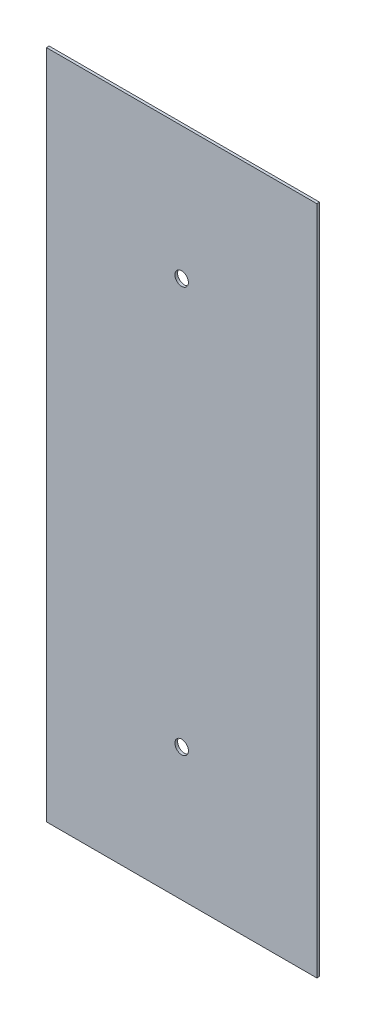
ISO-10303-21;
HEADER;
FILE_DESCRIPTION(('STEP AP214'),'2;1');
FILE_NAME('part.step','',(''),(''),'','','');
FILE_SCHEMA(('AUTOMOTIVE_DESIGN { 1 0 10303 214 1 1 1 1 }'));
ENDSEC;
DATA;
#1=APPLICATION_CONTEXT('core data for automotive mechanical design processes');
#2=APPLICATION_PROTOCOL_DEFINITION('international standard','automotive_design',2000,#1);
#3=PRODUCT_CONTEXT('',#1,'mechanical');
#4=PRODUCT('Part','Part','',(#3));
#5=PRODUCT_RELATED_PRODUCT_CATEGORY('part','',(#4));
#6=PRODUCT_DEFINITION_FORMATION('','',#4);
#7=PRODUCT_DEFINITION_CONTEXT('part definition',#1,'design');
#8=PRODUCT_DEFINITION('design','',#6,#7);
#9=PRODUCT_DEFINITION_SHAPE('','',#8);
#10=(LENGTH_UNIT() NAMED_UNIT(*) SI_UNIT(.MILLI.,.METRE.));
#11=(NAMED_UNIT(*) PLANE_ANGLE_UNIT() SI_UNIT($,.RADIAN.));
#12=(NAMED_UNIT(*) SI_UNIT($,.STERADIAN.) SOLID_ANGLE_UNIT());
#13=UNCERTAINTY_MEASURE_WITH_UNIT(LENGTH_MEASURE(1.E-05),#10,'distance_accuracy_value','');
#14=(GEOMETRIC_REPRESENTATION_CONTEXT(3) GLOBAL_UNCERTAINTY_ASSIGNED_CONTEXT((#13)) GLOBAL_UNIT_ASSIGNED_CONTEXT((#10,
#11,#12)) REPRESENTATION_CONTEXT('',''));
#15=CARTESIAN_POINT('',(0.,0.,0.));
#16=DIRECTION('',(0.,0.,1.));
#17=DIRECTION('',(1.,0.,0.));
#18=AXIS2_PLACEMENT_3D('',#15,#16,#17);
#19=CARTESIAN_POINT('',(0.,0.,2.));
#20=DIRECTION('',(0.,0.,-1.));
#21=DIRECTION('',(-1.,0.,0.));
#22=AXIS2_PLACEMENT_3D('',#19,#20,#21);
#23=PLANE('',#22);
#24=CARTESIAN_POINT('',(0.,-150.,2.));
#25=DIRECTION('',(0.,0.,-1.));
#26=DIRECTION('',(-1.,0.,0.));
#27=AXIS2_PLACEMENT_3D('',#24,#25,#26);
#28=CIRCLE('',#27,5.);
#29=CARTESIAN_POINT('',(-5.,-150.,2.));
#30=VERTEX_POINT('',#29);
#31=EDGE_CURVE('E84',#30,#30,#28,.T.);
#32=ORIENTED_EDGE('',*,*,#31,.T.);
#33=EDGE_LOOP('',(#32));
#34=FACE_BOUND('',#33,.T.);
#35=CARTESIAN_POINT('',(0.,150.,2.));
#36=DIRECTION('',(0.,0.,-1.));
#37=DIRECTION('',(-1.,0.,0.));
#38=AXIS2_PLACEMENT_3D('',#35,#36,#37);
#39=CIRCLE('',#38,5.);
#40=CARTESIAN_POINT('',(-5.,150.,2.));
#41=VERTEX_POINT('',#40);
#42=EDGE_CURVE('E19',#41,#41,#39,.T.);
#43=ORIENTED_EDGE('',*,*,#42,.T.);
#44=EDGE_LOOP('',(#43));
#45=FACE_BOUND('',#44,.T.);
#46=DIRECTION('',(1.,0.,0.));
#47=VECTOR('',#46,1.);
#48=CARTESIAN_POINT('',(100.,-248.,2.));
#49=LINE('',#48,#47);
#50=CARTESIAN_POINT('',(-100.,-248.,2.));
#51=VERTEX_POINT('',#50);
#52=CARTESIAN_POINT('',(100.,-248.,2.));
#53=VERTEX_POINT('',#52);
#54=EDGE_CURVE('E88',#51,#53,#49,.T.);
#55=ORIENTED_EDGE('',*,*,#54,.T.);
#56=DIRECTION('',(0.,-1.,0.));
#57=VECTOR('',#56,1.);
#58=CARTESIAN_POINT('',(100.,248.,2.));
#59=LINE('',#58,#57);
#60=CARTESIAN_POINT('',(100.,248.,2.));
#61=VERTEX_POINT('',#60);
#62=EDGE_CURVE('E54',#53,#61,#59,.F.);
#63=ORIENTED_EDGE('',*,*,#62,.T.);
#64=DIRECTION('',(1.,0.,0.));
#65=VECTOR('',#64,1.);
#66=CARTESIAN_POINT('',(100.,248.,2.));
#67=LINE('',#66,#65);
#68=CARTESIAN_POINT('',(-100.,248.,2.));
#69=VERTEX_POINT('',#68);
#70=EDGE_CURVE('E56',#61,#69,#67,.F.);
#71=ORIENTED_EDGE('',*,*,#70,.T.);
#72=DIRECTION('',(0.,1.,0.));
#73=VECTOR('',#72,1.);
#74=CARTESIAN_POINT('',(-100.,248.,2.));
#75=LINE('',#74,#73);
#76=EDGE_CURVE('E58',#69,#51,#75,.F.);
#77=ORIENTED_EDGE('',*,*,#76,.T.);
#78=EDGE_LOOP('',(#55,#63,#71,#77));
#79=FACE_BOUND('',#78,.T.);
#80=ADVANCED_FACE('F16',(#34,#45,#79),#23,.F.);
#81=CARTESIAN_POINT('',(0.,150.,2.));
#82=DIRECTION('',(0.,0.,-1.));
#83=DIRECTION('',(-1.,0.,0.));
#84=AXIS2_PLACEMENT_3D('',#81,#82,#83);
#85=CYLINDRICAL_SURFACE('',#84,5.);
#86=ORIENTED_EDGE('',*,*,#42,.F.);
#87=EDGE_LOOP('',(#86));
#88=FACE_BOUND('',#87,.T.);
#89=CARTESIAN_POINT('',(0.,150.,0.));
#90=DIRECTION('',(0.,0.,-1.));
#91=DIRECTION('',(-1.,0.,0.));
#92=AXIS2_PLACEMENT_3D('',#89,#90,#91);
#93=CIRCLE('',#92,5.);
#94=CARTESIAN_POINT('',(-5.,150.,0.));
#95=VERTEX_POINT('',#94);
#96=EDGE_CURVE('E81',#95,#95,#93,.F.);
#97=ORIENTED_EDGE('',*,*,#96,.F.);
#98=EDGE_LOOP('',(#97));
#99=FACE_BOUND('',#98,.T.);
#100=ADVANCED_FACE('F159',(#88,#99),#85,.F.);
#101=CARTESIAN_POINT('',(-100.,248.,2.));
#102=DIRECTION('',(1.,0.,0.));
#103=DIRECTION('',(0.,1.,0.));
#104=AXIS2_PLACEMENT_3D('',#101,#102,#103);
#105=PLANE('',#104);
#106=DIRECTION('',(0.,0.,1.));
#107=VECTOR('',#106,1.);
#108=CARTESIAN_POINT('',(-100.,-248.,2.));
#109=LINE('',#108,#107);
#110=CARTESIAN_POINT('',(-100.,-248.,0.));
#111=VERTEX_POINT('',#110);
#112=EDGE_CURVE('E69',#111,#51,#109,.T.);
#113=ORIENTED_EDGE('',*,*,#112,.T.);
#114=ORIENTED_EDGE('',*,*,#76,.F.);
#115=DIRECTION('',(0.,0.,1.));
#116=VECTOR('',#115,1.);
#117=CARTESIAN_POINT('',(-100.,248.,2.));
#118=LINE('',#117,#116);
#119=CARTESIAN_POINT('',(-100.,248.,0.));
#120=VERTEX_POINT('',#119);
#121=EDGE_CURVE('E63',#69,#120,#118,.F.);
#122=ORIENTED_EDGE('',*,*,#121,.T.);
#123=DIRECTION('',(0.,1.,0.));
#124=VECTOR('',#123,1.);
#125=CARTESIAN_POINT('',(-100.,0.,0.));
#126=LINE('',#125,#124);
#127=EDGE_CURVE('E83',#111,#120,#126,.T.);
#128=ORIENTED_EDGE('',*,*,#127,.F.);
#129=EDGE_LOOP('',(#113,#114,#122,#128));
#130=FACE_BOUND('',#129,.T.);
#131=ADVANCED_FACE('F66',(#130),#105,.F.);
#132=CARTESIAN_POINT('',(100.,248.,2.));
#133=DIRECTION('',(0.,-1.,0.));
#134=DIRECTION('',(1.,0.,0.));
#135=AXIS2_PLACEMENT_3D('',#132,#133,#134);
#136=PLANE('',#135);
#137=ORIENTED_EDGE('',*,*,#121,.F.);
#138=ORIENTED_EDGE('',*,*,#70,.F.);
#139=DIRECTION('',(0.,0.,1.));
#140=VECTOR('',#139,1.);
#141=CARTESIAN_POINT('',(100.,248.,2.));
#142=LINE('',#141,#140);
#143=CARTESIAN_POINT('',(100.,248.,0.));
#144=VERTEX_POINT('',#143);
#145=EDGE_CURVE('E77',#61,#144,#142,.F.);
#146=ORIENTED_EDGE('',*,*,#145,.T.);
#147=DIRECTION('',(-1.,0.,0.));
#148=VECTOR('',#147,1.);
#149=CARTESIAN_POINT('',(0.,248.,0.));
#150=LINE('',#149,#148);
#151=EDGE_CURVE('E74',#120,#144,#150,.F.);
#152=ORIENTED_EDGE('',*,*,#151,.F.);
#153=EDGE_LOOP('',(#137,#138,#146,#152));
#154=FACE_BOUND('',#153,.T.);
#155=ADVANCED_FACE('F72',(#154),#136,.F.);
#156=CARTESIAN_POINT('',(100.,248.,2.));
#157=DIRECTION('',(-1.,0.,0.));
#158=DIRECTION('',(0.,-1.,0.));
#159=AXIS2_PLACEMENT_3D('',#156,#157,#158);
#160=PLANE('',#159);
#161=ORIENTED_EDGE('',*,*,#145,.F.);
#162=ORIENTED_EDGE('',*,*,#62,.F.);
#163=DIRECTION('',(0.,0.,1.));
#164=VECTOR('',#163,1.);
#165=CARTESIAN_POINT('',(100.,-248.,2.));
#166=LINE('',#165,#164);
#167=CARTESIAN_POINT('',(100.,-248.,0.));
#168=VERTEX_POINT('',#167);
#169=EDGE_CURVE('E34',#53,#168,#166,.F.);
#170=ORIENTED_EDGE('',*,*,#169,.T.);
#171=DIRECTION('',(0.,1.,0.));
#172=VECTOR('',#171,1.);
#173=CARTESIAN_POINT('',(100.,0.,0.));
#174=LINE('',#173,#172);
#175=EDGE_CURVE('E95',#144,#168,#174,.F.);
#176=ORIENTED_EDGE('',*,*,#175,.F.);
#177=EDGE_LOOP('',(#161,#162,#170,#176));
#178=FACE_BOUND('',#177,.T.);
#179=ADVANCED_FACE('F96',(#178),#160,.F.);
#180=CARTESIAN_POINT('',(100.,-248.,2.));
#181=DIRECTION('',(0.,1.,0.));
#182=DIRECTION('',(0.,0.,1.));
#183=AXIS2_PLACEMENT_3D('',#180,#181,#182);
#184=PLANE('',#183);
#185=ORIENTED_EDGE('',*,*,#169,.F.);
#186=ORIENTED_EDGE('',*,*,#54,.F.);
#187=ORIENTED_EDGE('',*,*,#112,.F.);
#188=DIRECTION('',(-1.,0.,0.));
#189=VECTOR('',#188,1.);
#190=CARTESIAN_POINT('',(0.,-248.,0.));
#191=LINE('',#190,#189);
#192=EDGE_CURVE('E25',#168,#111,#191,.T.);
#193=ORIENTED_EDGE('',*,*,#192,.F.);
#194=EDGE_LOOP('',(#185,#186,#187,#193));
#195=FACE_BOUND('',#194,.T.);
#196=ADVANCED_FACE('F104',(#195),#184,.F.);
#197=CARTESIAN_POINT('',(0.,-150.,2.));
#198=DIRECTION('',(0.,0.,-1.));
#199=DIRECTION('',(-1.,0.,0.));
#200=AXIS2_PLACEMENT_3D('',#197,#198,#199);
#201=CYLINDRICAL_SURFACE('',#200,5.);
#202=ORIENTED_EDGE('',*,*,#31,.F.);
#203=EDGE_LOOP('',(#202));
#204=FACE_BOUND('',#203,.T.);
#205=CARTESIAN_POINT('',(0.,-150.,0.));
#206=DIRECTION('',(0.,0.,-1.));
#207=DIRECTION('',(-1.,0.,0.));
#208=AXIS2_PLACEMENT_3D('',#205,#206,#207);
#209=CIRCLE('',#208,5.);
#210=CARTESIAN_POINT('',(-5.,-150.,0.));
#211=VERTEX_POINT('',#210);
#212=EDGE_CURVE('E11',#211,#211,#209,.F.);
#213=ORIENTED_EDGE('',*,*,#212,.F.);
#214=EDGE_LOOP('',(#213));
#215=FACE_BOUND('',#214,.T.);
#216=ADVANCED_FACE('F106',(#204,#215),#201,.F.);
#217=CARTESIAN_POINT('',(0.,0.,0.));
#218=DIRECTION('',(0.,0.,-1.));
#219=DIRECTION('',(-1.,0.,0.));
#220=AXIS2_PLACEMENT_3D('',#217,#218,#219);
#221=PLANE('',#220);
#222=ORIENTED_EDGE('',*,*,#212,.T.);
#223=EDGE_LOOP('',(#222));
#224=FACE_BOUND('',#223,.T.);
#225=ORIENTED_EDGE('',*,*,#175,.T.);
#226=ORIENTED_EDGE('',*,*,#192,.T.);
#227=ORIENTED_EDGE('',*,*,#127,.T.);
#228=ORIENTED_EDGE('',*,*,#151,.T.);
#229=EDGE_LOOP('',(#225,#226,#227,#228));
#230=FACE_BOUND('',#229,.T.);
#231=ORIENTED_EDGE('',*,*,#96,.T.);
#232=EDGE_LOOP('',(#231));
#233=FACE_BOUND('',#232,.T.);
#234=ADVANCED_FACE('F100',(#224,#230,#233),#221,.T.);
#235=CLOSED_SHELL('',(#80,#100,#131,#155,#179,#196,#216,#234));
#236=MANIFOLD_SOLID_BREP('B1',#235);
#237=ADVANCED_BREP_SHAPE_REPRESENTATION('',(#18,#236),#14);
#238=SHAPE_DEFINITION_REPRESENTATION(#9,#237);
ENDSEC;
END-ISO-10303-21;
